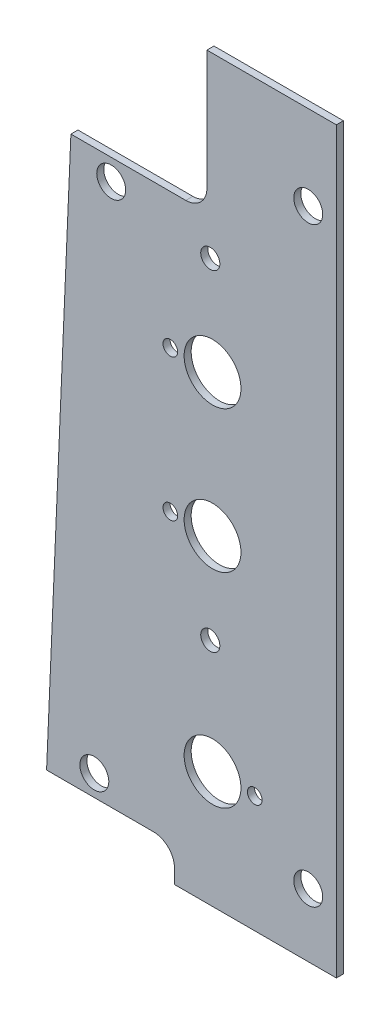
ISO-10303-21;
HEADER;
FILE_DESCRIPTION(('STEP AP214'),'2;1');
FILE_NAME('part.step','',(''),(''),'','','');
FILE_SCHEMA(('AUTOMOTIVE_DESIGN { 1 0 10303 214 1 1 1 1 }'));
ENDSEC;
DATA;
#1=APPLICATION_CONTEXT('core data for automotive mechanical design processes');
#2=APPLICATION_PROTOCOL_DEFINITION('international standard','automotive_design',2000,#1);
#3=PRODUCT_CONTEXT('',#1,'mechanical');
#4=PRODUCT('Part','Part','',(#3));
#5=PRODUCT_RELATED_PRODUCT_CATEGORY('part','',(#4));
#6=PRODUCT_DEFINITION_FORMATION('','',#4);
#7=PRODUCT_DEFINITION_CONTEXT('part definition',#1,'design');
#8=PRODUCT_DEFINITION('design','',#6,#7);
#9=PRODUCT_DEFINITION_SHAPE('','',#8);
#10=(LENGTH_UNIT() NAMED_UNIT(*) SI_UNIT(.MILLI.,.METRE.));
#11=(NAMED_UNIT(*) PLANE_ANGLE_UNIT() SI_UNIT($,.RADIAN.));
#12=(NAMED_UNIT(*) SI_UNIT($,.STERADIAN.) SOLID_ANGLE_UNIT());
#13=UNCERTAINTY_MEASURE_WITH_UNIT(LENGTH_MEASURE(1.E-05),#10,'distance_accuracy_value','');
#14=(GEOMETRIC_REPRESENTATION_CONTEXT(3) GLOBAL_UNCERTAINTY_ASSIGNED_CONTEXT((#13)) GLOBAL_UNIT_ASSIGNED_CONTEXT((#10,
#11,#12)) REPRESENTATION_CONTEXT('',''));
#15=CARTESIAN_POINT('',(0.,0.,0.));
#16=DIRECTION('',(0.,0.,1.));
#17=DIRECTION('',(1.,0.,0.));
#18=AXIS2_PLACEMENT_3D('',#15,#16,#17);
#19=CARTESIAN_POINT('',(0.01,166.6875,-0.01));
#20=DIRECTION('',(0.,1.,0.));
#21=DIRECTION('',(-1.,0.,0.));
#22=AXIS2_PLACEMENT_3D('',#19,#20,#21);
#23=PLANE('',#22);
#24=DIRECTION('',(-1.,0.,0.));
#25=VECTOR('',#24,1.);
#26=CARTESIAN_POINT('',(-32.6897252941176,166.6875,1.5875));
#27=LINE('',#26,#25);
#28=CARTESIAN_POINT('',(0.,166.6875,1.5875));
#29=VERTEX_POINT('',#28);
#30=CARTESIAN_POINT('',(-29.21,166.6875,1.5875));
#31=VERTEX_POINT('',#30);
#32=EDGE_CURVE('E111',#29,#31,#27,.T.);
#33=ORIENTED_EDGE('',*,*,#32,.F.);
#34=DIRECTION('',(0.,0.,1.));
#35=VECTOR('',#34,1.);
#36=CARTESIAN_POINT('',(0.,166.6875,0.793750000000001));
#37=LINE('',#36,#35);
#38=CARTESIAN_POINT('',(0.,166.6875,0.));
#39=VERTEX_POINT('',#38);
#40=EDGE_CURVE('E95',#39,#29,#37,.T.);
#41=ORIENTED_EDGE('',*,*,#40,.F.);
#42=DIRECTION('',(1.,0.,0.));
#43=VECTOR('',#42,1.);
#44=CARTESIAN_POINT('',(-32.6897252941177,166.6875,0.));
#45=LINE('',#44,#43);
#46=CARTESIAN_POINT('',(-29.21,166.6875,0.));
#47=VERTEX_POINT('',#46);
#48=EDGE_CURVE('E98',#47,#39,#45,.T.);
#49=ORIENTED_EDGE('',*,*,#48,.F.);
#50=DIRECTION('',(0.,0.,-1.));
#51=VECTOR('',#50,1.);
#52=CARTESIAN_POINT('',(-29.21,166.6875,0.793750000000001));
#53=LINE('',#52,#51);
#54=EDGE_CURVE('E78',#31,#47,#53,.T.);
#55=ORIENTED_EDGE('',*,*,#54,.F.);
#56=EDGE_LOOP('',(#33,#41,#49,#55));
#57=FACE_BOUND('',#56,.T.);
#58=ADVANCED_FACE('F16',(#57),#23,.T.);
#59=CARTESIAN_POINT('',(0.,-0.01,-0.01));
#60=DIRECTION('',(1.,0.,0.));
#61=DIRECTION('',(0.,1.,0.));
#62=AXIS2_PLACEMENT_3D('',#59,#60,#61);
#63=PLANE('',#62);
#64=DIRECTION('',(0.,1.,0.));
#65=VECTOR('',#64,1.);
#66=CARTESIAN_POINT('',(0.,83.34375,1.5875));
#67=LINE('',#66,#65);
#68=CARTESIAN_POINT('',(0.,0.,1.5875));
#69=VERTEX_POINT('',#68);
#70=EDGE_CURVE('E190',#69,#29,#67,.T.);
#71=ORIENTED_EDGE('',*,*,#70,.F.);
#72=DIRECTION('',(0.,0.,1.));
#73=VECTOR('',#72,1.);
#74=CARTESIAN_POINT('',(0.,0.,0.793750000000001));
#75=LINE('',#74,#73);
#76=CARTESIAN_POINT('',(0.,0.,0.));
#77=VERTEX_POINT('',#76);
#78=EDGE_CURVE('E172',#77,#69,#75,.T.);
#79=ORIENTED_EDGE('',*,*,#78,.F.);
#80=DIRECTION('',(0.,-1.,0.));
#81=VECTOR('',#80,1.);
#82=CARTESIAN_POINT('',(0.,83.34375,0.));
#83=LINE('',#82,#81);
#84=EDGE_CURVE('E102',#39,#77,#83,.T.);
#85=ORIENTED_EDGE('',*,*,#84,.F.);
#86=ORIENTED_EDGE('',*,*,#40,.T.);
#87=EDGE_LOOP('',(#71,#79,#85,#86));
#88=FACE_BOUND('',#87,.T.);
#89=ADVANCED_FACE('F296',(#88),#63,.T.);
#90=CARTESIAN_POINT('',(-36.5225,0.,-0.01));
#91=DIRECTION('',(0.,-1.,0.));
#92=DIRECTION('',(1.,0.,0.));
#93=AXIS2_PLACEMENT_3D('',#90,#91,#92);
#94=PLANE('',#93);
#95=DIRECTION('',(1.,0.,0.));
#96=VECTOR('',#95,1.);
#97=CARTESIAN_POINT('',(-32.6897252941176,0.,1.5875));
#98=LINE('',#97,#96);
#99=CARTESIAN_POINT('',(-36.5125,0.,1.5875));
#100=VERTEX_POINT('',#99);
#101=EDGE_CURVE('E141',#100,#69,#98,.T.);
#102=ORIENTED_EDGE('',*,*,#101,.F.);
#103=DIRECTION('',(0.,0.,1.));
#104=VECTOR('',#103,1.);
#105=CARTESIAN_POINT('',(-36.5125,0.,0.793750000000001));
#106=LINE('',#105,#104);
#107=CARTESIAN_POINT('',(-36.5125,0.,0.));
#108=VERTEX_POINT('',#107);
#109=EDGE_CURVE('E170',#108,#100,#106,.T.);
#110=ORIENTED_EDGE('',*,*,#109,.F.);
#111=DIRECTION('',(-1.,0.,0.));
#112=VECTOR('',#111,1.);
#113=CARTESIAN_POINT('',(-32.6897252941177,0.,0.));
#114=LINE('',#113,#112);
#115=EDGE_CURVE('E135',#77,#108,#114,.T.);
#116=ORIENTED_EDGE('',*,*,#115,.F.);
#117=ORIENTED_EDGE('',*,*,#78,.T.);
#118=EDGE_LOOP('',(#102,#110,#116,#117));
#119=FACE_BOUND('',#118,.T.);
#120=ADVANCED_FACE('F293',(#119),#94,.T.);
#121=CARTESIAN_POINT('',(-36.5125,3.18500000000001,-0.01));
#122=DIRECTION('',(-1.,0.,0.));
#123=DIRECTION('',(0.,-1.,0.));
#124=AXIS2_PLACEMENT_3D('',#121,#122,#123);
#125=PLANE('',#124);
#126=ORIENTED_EDGE('',*,*,#109,.T.);
#127=DIRECTION('',(0.,-1.,0.));
#128=VECTOR('',#127,1.);
#129=CARTESIAN_POINT('',(-36.5125,83.34375,1.5875));
#130=LINE('',#129,#128);
#131=CARTESIAN_POINT('',(-36.5125,3.175,1.5875));
#132=VERTEX_POINT('',#131);
#133=EDGE_CURVE('E138',#132,#100,#130,.T.);
#134=ORIENTED_EDGE('',*,*,#133,.F.);
#135=DIRECTION('',(0.,0.,1.));
#136=VECTOR('',#135,1.);
#137=CARTESIAN_POINT('',(-36.5125,3.175,0.79375));
#138=LINE('',#137,#136);
#139=CARTESIAN_POINT('',(-36.5125,3.175,0.));
#140=VERTEX_POINT('',#139);
#141=EDGE_CURVE('E168',#140,#132,#138,.T.);
#142=ORIENTED_EDGE('',*,*,#141,.F.);
#143=DIRECTION('',(0.,1.,0.));
#144=VECTOR('',#143,1.);
#145=CARTESIAN_POINT('',(-36.5125,83.34375,0.));
#146=LINE('',#145,#144);
#147=EDGE_CURVE('E132',#108,#140,#146,.T.);
#148=ORIENTED_EDGE('',*,*,#147,.F.);
#149=EDGE_LOOP('',(#126,#134,#142,#148));
#150=FACE_BOUND('',#149,.T.);
#151=ADVANCED_FACE('F289',(#150),#125,.T.);
#152=CARTESIAN_POINT('',(-41.275,3.175,0.));
#153=DIRECTION('',(0.,0.,1.));
#154=DIRECTION('',(1.,0.,0.));
#155=AXIS2_PLACEMENT_3D('',#152,#153,#154);
#156=CYLINDRICAL_SURFACE('',#155,4.7625);
#157=CARTESIAN_POINT('',(-41.275,3.175,1.5875));
#158=DIRECTION('',(0.,0.,1.));
#159=DIRECTION('',(1.,0.,0.));
#160=AXIS2_PLACEMENT_3D('',#157,#158,#159);
#161=CIRCLE('',#160,4.7625);
#162=CARTESIAN_POINT('',(-41.275,7.9375,1.5875));
#163=VERTEX_POINT('',#162);
#164=EDGE_CURVE('E142',#163,#132,#161,.F.);
#165=ORIENTED_EDGE('',*,*,#164,.F.);
#166=DIRECTION('',(0.,0.,1.));
#167=VECTOR('',#166,1.);
#168=CARTESIAN_POINT('',(-41.275,7.9375,0.793750000000001));
#169=LINE('',#168,#167);
#170=CARTESIAN_POINT('',(-41.275,7.9375,0.));
#171=VERTEX_POINT('',#170);
#172=EDGE_CURVE('E166',#171,#163,#169,.T.);
#173=ORIENTED_EDGE('',*,*,#172,.F.);
#174=CARTESIAN_POINT('',(-41.275,3.175,0.));
#175=DIRECTION('',(0.,0.,1.));
#176=DIRECTION('',(1.,0.,0.));
#177=AXIS2_PLACEMENT_3D('',#174,#175,#176);
#178=CIRCLE('',#177,4.7625);
#179=EDGE_CURVE('E131',#140,#171,#178,.T.);
#180=ORIENTED_EDGE('',*,*,#179,.F.);
#181=ORIENTED_EDGE('',*,*,#141,.T.);
#182=EDGE_LOOP('',(#165,#173,#180,#181));
#183=FACE_BOUND('',#182,.T.);
#184=ADVANCED_FACE('F285',(#183),#156,.F.);
#185=CARTESIAN_POINT('',(-65.3894505882353,7.9375,-0.01));
#186=DIRECTION('',(0.,-1.,0.));
#187=DIRECTION('',(1.,0.,0.));
#188=AXIS2_PLACEMENT_3D('',#185,#186,#187);
#189=PLANE('',#188);
#190=DIRECTION('',(0.,0.,1.));
#191=VECTOR('',#190,1.);
#192=CARTESIAN_POINT('',(-65.3794505882353,7.9375,0.793750000000001));
#193=LINE('',#192,#191);
#194=CARTESIAN_POINT('',(-65.3794505882353,7.9375,0.));
#195=VERTEX_POINT('',#194);
#196=CARTESIAN_POINT('',(-65.3794505882353,7.9375,1.5875));
#197=VERTEX_POINT('',#196);
#198=EDGE_CURVE('E164',#195,#197,#193,.T.);
#199=ORIENTED_EDGE('',*,*,#198,.F.);
#200=DIRECTION('',(-1.,0.,0.));
#201=VECTOR('',#200,1.);
#202=CARTESIAN_POINT('',(-32.6897252941177,7.9375,0.));
#203=LINE('',#202,#201);
#204=EDGE_CURVE('E128',#171,#195,#203,.T.);
#205=ORIENTED_EDGE('',*,*,#204,.F.);
#206=ORIENTED_EDGE('',*,*,#172,.T.);
#207=DIRECTION('',(1.,0.,0.));
#208=VECTOR('',#207,1.);
#209=CARTESIAN_POINT('',(-32.6897252941176,7.9375,1.5875));
#210=LINE('',#209,#208);
#211=EDGE_CURVE('E145',#197,#163,#210,.T.);
#212=ORIENTED_EDGE('',*,*,#211,.F.);
#213=EDGE_LOOP('',(#199,#205,#206,#212));
#214=FACE_BOUND('',#213,.T.);
#215=ADVANCED_FACE('F281',(#214),#189,.T.);
#216=CARTESIAN_POINT('',(-59.8902282148351,134.94749067373,-0.01));
#217=DIRECTION('',(-0.999067372960438,0.0431785164859707,0.));
#218=DIRECTION('',(-0.0431785164859707,-0.999067372960438,0.));
#219=AXIS2_PLACEMENT_3D('',#216,#217,#218);
#220=PLANE('',#219);
#221=DIRECTION('',(-0.0431785164859705,-0.999067372960438,0.));
#222=VECTOR('',#221,1.);
#223=CARTESIAN_POINT('',(-59.89066,134.9375,1.5875));
#224=LINE('',#223,#222);
#225=CARTESIAN_POINT('',(-59.89066,134.9375,1.5875));
#226=VERTEX_POINT('',#225);
#227=EDGE_CURVE('E148',#226,#197,#224,.T.);
#228=ORIENTED_EDGE('',*,*,#227,.F.);
#229=DIRECTION('',(0.,0.,1.));
#230=VECTOR('',#229,1.);
#231=CARTESIAN_POINT('',(-59.89066,134.9375,0.793750000000001));
#232=LINE('',#231,#230);
#233=CARTESIAN_POINT('',(-59.89066,134.9375,0.));
#234=VERTEX_POINT('',#233);
#235=EDGE_CURVE('E162',#234,#226,#232,.T.);
#236=ORIENTED_EDGE('',*,*,#235,.F.);
#237=DIRECTION('',(0.0431785164859705,0.999067372960438,0.));
#238=VECTOR('',#237,1.);
#239=CARTESIAN_POINT('',(-65.3794505882353,7.9375,0.));
#240=LINE('',#239,#238);
#241=EDGE_CURVE('E127',#195,#234,#240,.T.);
#242=ORIENTED_EDGE('',*,*,#241,.F.);
#243=ORIENTED_EDGE('',*,*,#198,.T.);
#244=EDGE_LOOP('',(#228,#236,#242,#243));
#245=FACE_BOUND('',#244,.T.);
#246=ADVANCED_FACE('F276',(#245),#220,.T.);
#247=CARTESIAN_POINT('',(-33.9625,134.9375,-0.01));
#248=DIRECTION('',(0.,1.,0.));
#249=DIRECTION('',(-1.,0.,0.));
#250=AXIS2_PLACEMENT_3D('',#247,#248,#249);
#251=PLANE('',#250);
#252=ORIENTED_EDGE('',*,*,#235,.T.);
#253=DIRECTION('',(-1.,0.,0.));
#254=VECTOR('',#253,1.);
#255=CARTESIAN_POINT('',(-32.6897252941176,134.9375,1.5875));
#256=LINE('',#255,#254);
#257=CARTESIAN_POINT('',(-33.9725,134.9375,1.5875));
#258=VERTEX_POINT('',#257);
#259=EDGE_CURVE('E149',#258,#226,#256,.T.);
#260=ORIENTED_EDGE('',*,*,#259,.F.);
#261=DIRECTION('',(0.,0.,1.));
#262=VECTOR('',#261,1.);
#263=CARTESIAN_POINT('',(-33.9725,134.9375,0.79375));
#264=LINE('',#263,#262);
#265=CARTESIAN_POINT('',(-33.9725,134.9375,0.));
#266=VERTEX_POINT('',#265);
#267=EDGE_CURVE('E155',#266,#258,#264,.T.);
#268=ORIENTED_EDGE('',*,*,#267,.F.);
#269=DIRECTION('',(1.,0.,0.));
#270=VECTOR('',#269,1.);
#271=CARTESIAN_POINT('',(-32.6897252941177,134.9375,0.));
#272=LINE('',#271,#270);
#273=EDGE_CURVE('E121',#234,#266,#272,.T.);
#274=ORIENTED_EDGE('',*,*,#273,.F.);
#275=EDGE_LOOP('',(#252,#260,#268,#274));
#276=FACE_BOUND('',#275,.T.);
#277=ADVANCED_FACE('F299',(#276),#251,.T.);
#278=CARTESIAN_POINT('',(-33.9725,139.7,0.));
#279=DIRECTION('',(0.,0.,1.));
#280=DIRECTION('',(1.,0.,0.));
#281=AXIS2_PLACEMENT_3D('',#278,#279,#280);
#282=CYLINDRICAL_SURFACE('',#281,4.76250000000002);
#283=CARTESIAN_POINT('',(-33.9725,139.7,1.5875));
#284=DIRECTION('',(0.,0.,1.));
#285=DIRECTION('',(1.,0.,0.));
#286=AXIS2_PLACEMENT_3D('',#283,#284,#285);
#287=CIRCLE('',#286,4.76250000000002);
#288=CARTESIAN_POINT('',(-29.21,139.7,1.5875));
#289=VERTEX_POINT('',#288);
#290=EDGE_CURVE('E20',#289,#258,#287,.F.);
#291=ORIENTED_EDGE('',*,*,#290,.F.);
#292=DIRECTION('',(0.,0.,1.));
#293=VECTOR('',#292,1.);
#294=CARTESIAN_POINT('',(-29.21,139.7,0.793750000000001));
#295=LINE('',#294,#293);
#296=CARTESIAN_POINT('',(-29.21,139.7,0.));
#297=VERTEX_POINT('',#296);
#298=EDGE_CURVE('E35',#297,#289,#295,.T.);
#299=ORIENTED_EDGE('',*,*,#298,.F.);
#300=CARTESIAN_POINT('',(-33.9725,139.7,0.));
#301=DIRECTION('',(0.,0.,1.));
#302=DIRECTION('',(1.,0.,0.));
#303=AXIS2_PLACEMENT_3D('',#300,#301,#302);
#304=CIRCLE('',#303,4.76250000000002);
#305=EDGE_CURVE('E115',#266,#297,#304,.T.);
#306=ORIENTED_EDGE('',*,*,#305,.F.);
#307=ORIENTED_EDGE('',*,*,#267,.T.);
#308=EDGE_LOOP('',(#291,#299,#306,#307));
#309=FACE_BOUND('',#308,.T.);
#310=ADVANCED_FACE('F297',(#309),#282,.F.);
#311=CARTESIAN_POINT('',(-29.21,166.6975,-0.01));
#312=DIRECTION('',(-1.,0.,0.));
#313=DIRECTION('',(0.,-1.,0.));
#314=AXIS2_PLACEMENT_3D('',#311,#312,#313);
#315=PLANE('',#314);
#316=ORIENTED_EDGE('',*,*,#54,.T.);
#317=DIRECTION('',(0.,1.,0.));
#318=VECTOR('',#317,1.);
#319=CARTESIAN_POINT('',(-29.21,83.34375,0.));
#320=LINE('',#319,#318);
#321=EDGE_CURVE('E106',#297,#47,#320,.T.);
#322=ORIENTED_EDGE('',*,*,#321,.F.);
#323=ORIENTED_EDGE('',*,*,#298,.T.);
#324=DIRECTION('',(0.,-1.,0.));
#325=VECTOR('',#324,1.);
#326=CARTESIAN_POINT('',(-29.21,83.34375,1.5875));
#327=LINE('',#326,#325);
#328=EDGE_CURVE('E109',#31,#289,#327,.T.);
#329=ORIENTED_EDGE('',*,*,#328,.F.);
#330=EDGE_LOOP('',(#316,#322,#323,#329));
#331=FACE_BOUND('',#330,.T.);
#332=ADVANCED_FACE('F105',(#331),#315,.T.);
#333=CARTESIAN_POINT('',(-28.448,126.365,1.5875));
#334=DIRECTION('',(0.,0.,-1.));
#335=DIRECTION('',(-1.,0.,0.));
#336=AXIS2_PLACEMENT_3D('',#333,#334,#335);
#337=CYLINDRICAL_SURFACE('',#336,2.15900000000002);
#338=CARTESIAN_POINT('',(-28.448,126.365,0.));
#339=DIRECTION('',(0.,0.,-1.));
#340=DIRECTION('',(-1.,0.,0.));
#341=AXIS2_PLACEMENT_3D('',#338,#339,#340);
#342=CIRCLE('',#341,2.15900000000002);
#343=CARTESIAN_POINT('',(-30.607,126.365,0.));
#344=VERTEX_POINT('',#343);
#345=EDGE_CURVE('E116',#344,#344,#342,.F.);
#346=ORIENTED_EDGE('',*,*,#345,.F.);
#347=EDGE_LOOP('',(#346));
#348=FACE_BOUND('',#347,.T.);
#349=CARTESIAN_POINT('',(-28.448,126.365,1.5875));
#350=DIRECTION('',(0.,0.,-1.));
#351=DIRECTION('',(-1.,0.,0.));
#352=AXIS2_PLACEMENT_3D('',#349,#350,#351);
#353=CIRCLE('',#352,2.15900000000002);
#354=CARTESIAN_POINT('',(-30.607,126.365,1.5875));
#355=VERTEX_POINT('',#354);
#356=EDGE_CURVE('E198',#355,#355,#353,.T.);
#357=ORIENTED_EDGE('',*,*,#356,.F.);
#358=EDGE_LOOP('',(#357));
#359=FACE_BOUND('',#358,.T.);
#360=ADVANCED_FACE('F365',(#348,#359),#337,.F.);
#361=CARTESIAN_POINT('',(-37.465,72.39,1.5875));
#362=DIRECTION('',(0.,0.,-1.));
#363=DIRECTION('',(-1.,0.,0.));
#364=AXIS2_PLACEMENT_3D('',#361,#362,#363);
#365=CYLINDRICAL_SURFACE('',#364,1.65099999999999);
#366=CARTESIAN_POINT('',(-37.465,72.39,0.));
#367=DIRECTION('',(0.,0.,-1.));
#368=DIRECTION('',(-1.,0.,0.));
#369=AXIS2_PLACEMENT_3D('',#366,#367,#368);
#370=CIRCLE('',#369,1.65099999999999);
#371=CARTESIAN_POINT('',(-39.116,72.39,0.));
#372=VERTEX_POINT('',#371);
#373=EDGE_CURVE('E119',#372,#372,#370,.F.);
#374=ORIENTED_EDGE('',*,*,#373,.F.);
#375=EDGE_LOOP('',(#374));
#376=FACE_BOUND('',#375,.T.);
#377=CARTESIAN_POINT('',(-37.465,72.39,1.5875));
#378=DIRECTION('',(0.,0.,-1.));
#379=DIRECTION('',(-1.,0.,0.));
#380=AXIS2_PLACEMENT_3D('',#377,#378,#379);
#381=CIRCLE('',#380,1.65099999999999);
#382=CARTESIAN_POINT('',(-39.116,72.39,1.5875));
#383=VERTEX_POINT('',#382);
#384=EDGE_CURVE('E262',#383,#383,#381,.T.);
#385=ORIENTED_EDGE('',*,*,#384,.F.);
#386=EDGE_LOOP('',(#385));
#387=FACE_BOUND('',#386,.T.);
#388=ADVANCED_FACE('F361',(#376,#387),#365,.F.);
#389=CARTESIAN_POINT('',(-27.94,26.3525,1.5875));
#390=DIRECTION('',(0.,0.,-1.));
#391=DIRECTION('',(-1.,0.,0.));
#392=AXIS2_PLACEMENT_3D('',#389,#390,#391);
#393=CYLINDRICAL_SURFACE('',#392,6.41349999999999);
#394=CARTESIAN_POINT('',(-27.94,26.3525,0.));
#395=DIRECTION('',(0.,0.,-1.));
#396=DIRECTION('',(-1.,0.,0.));
#397=AXIS2_PLACEMENT_3D('',#394,#395,#396);
#398=CIRCLE('',#397,6.41349999999999);
#399=CARTESIAN_POINT('',(-34.3535,26.3525,0.));
#400=VERTEX_POINT('',#399);
#401=EDGE_CURVE('E227',#400,#400,#398,.F.);
#402=ORIENTED_EDGE('',*,*,#401,.F.);
#403=EDGE_LOOP('',(#402));
#404=FACE_BOUND('',#403,.T.);
#405=CARTESIAN_POINT('',(-27.94,26.3525,1.5875));
#406=DIRECTION('',(0.,0.,-1.));
#407=DIRECTION('',(-1.,0.,0.));
#408=AXIS2_PLACEMENT_3D('',#405,#406,#407);
#409=CIRCLE('',#408,6.41349999999999);
#410=CARTESIAN_POINT('',(-34.3535,26.3525,1.5875));
#411=VERTEX_POINT('',#410);
#412=EDGE_CURVE('E259',#411,#411,#409,.T.);
#413=ORIENTED_EDGE('',*,*,#412,.F.);
#414=EDGE_LOOP('',(#413));
#415=FACE_BOUND('',#414,.T.);
#416=ADVANCED_FACE('F357',(#404,#415),#393,.F.);
#417=CARTESIAN_POINT('',(-37.465,104.394,1.5875));
#418=DIRECTION('',(0.,0.,-1.));
#419=DIRECTION('',(-1.,0.,0.));
#420=AXIS2_PLACEMENT_3D('',#417,#418,#419);
#421=CYLINDRICAL_SURFACE('',#420,1.65099999999999);
#422=CARTESIAN_POINT('',(-37.465,104.394,0.));
#423=DIRECTION('',(0.,0.,-1.));
#424=DIRECTION('',(-1.,0.,0.));
#425=AXIS2_PLACEMENT_3D('',#422,#423,#424);
#426=CIRCLE('',#425,1.65099999999999);
#427=CARTESIAN_POINT('',(-39.116,104.394,0.));
#428=VERTEX_POINT('',#427);
#429=EDGE_CURVE('E224',#428,#428,#426,.F.);
#430=ORIENTED_EDGE('',*,*,#429,.F.);
#431=EDGE_LOOP('',(#430));
#432=FACE_BOUND('',#431,.T.);
#433=CARTESIAN_POINT('',(-37.465,104.394,1.5875));
#434=DIRECTION('',(0.,0.,-1.));
#435=DIRECTION('',(-1.,0.,0.));
#436=AXIS2_PLACEMENT_3D('',#433,#434,#435);
#437=CIRCLE('',#436,1.65099999999999);
#438=CARTESIAN_POINT('',(-39.116,104.394,1.5875));
#439=VERTEX_POINT('',#438);
#440=EDGE_CURVE('E256',#439,#439,#437,.T.);
#441=ORIENTED_EDGE('',*,*,#440,.F.);
#442=EDGE_LOOP('',(#441));
#443=FACE_BOUND('',#442,.T.);
#444=ADVANCED_FACE('F353',(#432,#443),#421,.F.);
#445=CARTESIAN_POINT('',(-27.94,72.39,1.5875));
#446=DIRECTION('',(0.,0.,-1.));
#447=DIRECTION('',(-1.,0.,0.));
#448=AXIS2_PLACEMENT_3D('',#445,#446,#447);
#449=CYLINDRICAL_SURFACE('',#448,6.41349999999999);
#450=CARTESIAN_POINT('',(-27.94,72.39,0.));
#451=DIRECTION('',(0.,0.,-1.));
#452=DIRECTION('',(-1.,0.,0.));
#453=AXIS2_PLACEMENT_3D('',#450,#451,#452);
#454=CIRCLE('',#453,6.41349999999999);
#455=CARTESIAN_POINT('',(-34.3535,72.39,0.));
#456=VERTEX_POINT('',#455);
#457=EDGE_CURVE('E221',#456,#456,#454,.F.);
#458=ORIENTED_EDGE('',*,*,#457,.F.);
#459=EDGE_LOOP('',(#458));
#460=FACE_BOUND('',#459,.T.);
#461=CARTESIAN_POINT('',(-27.94,72.39,1.5875));
#462=DIRECTION('',(0.,0.,-1.));
#463=DIRECTION('',(-1.,0.,0.));
#464=AXIS2_PLACEMENT_3D('',#461,#462,#463);
#465=CIRCLE('',#464,6.41349999999999);
#466=CARTESIAN_POINT('',(-34.3535,72.39,1.5875));
#467=VERTEX_POINT('',#466);
#468=EDGE_CURVE('E253',#467,#467,#465,.T.);
#469=ORIENTED_EDGE('',*,*,#468,.F.);
#470=EDGE_LOOP('',(#469));
#471=FACE_BOUND('',#470,.T.);
#472=ADVANCED_FACE('F349',(#460,#471),#449,.F.);
#473=CARTESIAN_POINT('',(-18.415,26.3525,1.5875));
#474=DIRECTION('',(0.,0.,-1.));
#475=DIRECTION('',(-1.,0.,0.));
#476=AXIS2_PLACEMENT_3D('',#473,#474,#475);
#477=CYLINDRICAL_SURFACE('',#476,1.651);
#478=CARTESIAN_POINT('',(-18.415,26.3525,0.));
#479=DIRECTION('',(0.,0.,-1.));
#480=DIRECTION('',(-1.,0.,0.));
#481=AXIS2_PLACEMENT_3D('',#478,#479,#480);
#482=CIRCLE('',#481,1.651);
#483=CARTESIAN_POINT('',(-20.066,26.3525,0.));
#484=VERTEX_POINT('',#483);
#485=EDGE_CURVE('E218',#484,#484,#482,.F.);
#486=ORIENTED_EDGE('',*,*,#485,.F.);
#487=EDGE_LOOP('',(#486));
#488=FACE_BOUND('',#487,.T.);
#489=CARTESIAN_POINT('',(-18.415,26.3525,1.5875));
#490=DIRECTION('',(0.,0.,-1.));
#491=DIRECTION('',(-1.,0.,0.));
#492=AXIS2_PLACEMENT_3D('',#489,#490,#491);
#493=CIRCLE('',#492,1.651);
#494=CARTESIAN_POINT('',(-20.066,26.3525,1.5875));
#495=VERTEX_POINT('',#494);
#496=EDGE_CURVE('E250',#495,#495,#493,.T.);
#497=ORIENTED_EDGE('',*,*,#496,.F.);
#498=EDGE_LOOP('',(#497));
#499=FACE_BOUND('',#498,.T.);
#500=ADVANCED_FACE('F345',(#488,#499),#477,.F.);
#501=CARTESIAN_POINT('',(-27.94,104.394,1.5875));
#502=DIRECTION('',(0.,0.,-1.));
#503=DIRECTION('',(-1.,0.,0.));
#504=AXIS2_PLACEMENT_3D('',#501,#502,#503);
#505=CYLINDRICAL_SURFACE('',#504,6.41349999999999);
#506=CARTESIAN_POINT('',(-27.94,104.394,0.));
#507=DIRECTION('',(0.,0.,-1.));
#508=DIRECTION('',(-1.,0.,0.));
#509=AXIS2_PLACEMENT_3D('',#506,#507,#508);
#510=CIRCLE('',#509,6.41349999999999);
#511=CARTESIAN_POINT('',(-34.3535,104.394,0.));
#512=VERTEX_POINT('',#511);
#513=EDGE_CURVE('E215',#512,#512,#510,.F.);
#514=ORIENTED_EDGE('',*,*,#513,.F.);
#515=EDGE_LOOP('',(#514));
#516=FACE_BOUND('',#515,.T.);
#517=CARTESIAN_POINT('',(-27.94,104.394,1.5875));
#518=DIRECTION('',(0.,0.,-1.));
#519=DIRECTION('',(-1.,0.,0.));
#520=AXIS2_PLACEMENT_3D('',#517,#518,#519);
#521=CIRCLE('',#520,6.41349999999999);
#522=CARTESIAN_POINT('',(-34.3535,104.394,1.5875));
#523=VERTEX_POINT('',#522);
#524=EDGE_CURVE('E247',#523,#523,#521,.T.);
#525=ORIENTED_EDGE('',*,*,#524,.F.);
#526=EDGE_LOOP('',(#525));
#527=FACE_BOUND('',#526,.T.);
#528=ADVANCED_FACE('F341',(#516,#527),#505,.F.);
#529=CARTESIAN_POINT('',(-6.35,14.2875,1.5875));
#530=DIRECTION('',(0.,0.,-1.));
#531=DIRECTION('',(-1.,0.,0.));
#532=AXIS2_PLACEMENT_3D('',#529,#530,#531);
#533=CYLINDRICAL_SURFACE('',#532,3.2639);
#534=CARTESIAN_POINT('',(-6.35,14.2875,0.));
#535=DIRECTION('',(0.,0.,-1.));
#536=DIRECTION('',(-1.,0.,0.));
#537=AXIS2_PLACEMENT_3D('',#534,#535,#536);
#538=CIRCLE('',#537,3.2639);
#539=CARTESIAN_POINT('',(-9.6139,14.2875,0.));
#540=VERTEX_POINT('',#539);
#541=EDGE_CURVE('E212',#540,#540,#538,.F.);
#542=ORIENTED_EDGE('',*,*,#541,.F.);
#543=EDGE_LOOP('',(#542));
#544=FACE_BOUND('',#543,.T.);
#545=CARTESIAN_POINT('',(-6.35,14.2875,1.5875));
#546=DIRECTION('',(0.,0.,-1.));
#547=DIRECTION('',(-1.,0.,0.));
#548=AXIS2_PLACEMENT_3D('',#545,#546,#547);
#549=CIRCLE('',#548,3.2639);
#550=CARTESIAN_POINT('',(-9.6139,14.2875,1.5875));
#551=VERTEX_POINT('',#550);
#552=EDGE_CURVE('E244',#551,#551,#549,.T.);
#553=ORIENTED_EDGE('',*,*,#552,.F.);
#554=EDGE_LOOP('',(#553));
#555=FACE_BOUND('',#554,.T.);
#556=ADVANCED_FACE('F337',(#544,#555),#533,.F.);
#557=CARTESIAN_POINT('',(-50.8,130.175,1.5875));
#558=DIRECTION('',(0.,0.,-1.));
#559=DIRECTION('',(-1.,0.,0.));
#560=AXIS2_PLACEMENT_3D('',#557,#558,#559);
#561=CYLINDRICAL_SURFACE('',#560,3.26389999999998);
#562=CARTESIAN_POINT('',(-50.8,130.175,0.));
#563=DIRECTION('',(0.,0.,-1.));
#564=DIRECTION('',(-1.,0.,0.));
#565=AXIS2_PLACEMENT_3D('',#562,#563,#564);
#566=CIRCLE('',#565,3.26389999999998);
#567=CARTESIAN_POINT('',(-54.0639,130.175,0.));
#568=VERTEX_POINT('',#567);
#569=EDGE_CURVE('E209',#568,#568,#566,.F.);
#570=ORIENTED_EDGE('',*,*,#569,.F.);
#571=EDGE_LOOP('',(#570));
#572=FACE_BOUND('',#571,.T.);
#573=CARTESIAN_POINT('',(-50.8,130.175,1.5875));
#574=DIRECTION('',(0.,0.,-1.));
#575=DIRECTION('',(-1.,0.,0.));
#576=AXIS2_PLACEMENT_3D('',#573,#574,#575);
#577=CIRCLE('',#576,3.26389999999998);
#578=CARTESIAN_POINT('',(-54.0639,130.175,1.5875));
#579=VERTEX_POINT('',#578);
#580=EDGE_CURVE('E241',#579,#579,#577,.T.);
#581=ORIENTED_EDGE('',*,*,#580,.F.);
#582=EDGE_LOOP('',(#581));
#583=FACE_BOUND('',#582,.T.);
#584=ADVANCED_FACE('F333',(#572,#583),#561,.F.);
#585=CARTESIAN_POINT('',(-54.61,12.7,1.5875));
#586=DIRECTION('',(0.,0.,-1.));
#587=DIRECTION('',(-1.,0.,0.));
#588=AXIS2_PLACEMENT_3D('',#585,#586,#587);
#589=CYLINDRICAL_SURFACE('',#588,3.2639);
#590=CARTESIAN_POINT('',(-54.61,12.7,0.));
#591=DIRECTION('',(0.,0.,-1.));
#592=DIRECTION('',(-1.,0.,0.));
#593=AXIS2_PLACEMENT_3D('',#590,#591,#592);
#594=CIRCLE('',#593,3.2639);
#595=CARTESIAN_POINT('',(-57.8739,12.7,0.));
#596=VERTEX_POINT('',#595);
#597=EDGE_CURVE('E206',#596,#596,#594,.F.);
#598=ORIENTED_EDGE('',*,*,#597,.F.);
#599=EDGE_LOOP('',(#598));
#600=FACE_BOUND('',#599,.T.);
#601=CARTESIAN_POINT('',(-54.61,12.7,1.5875));
#602=DIRECTION('',(0.,0.,-1.));
#603=DIRECTION('',(-1.,0.,0.));
#604=AXIS2_PLACEMENT_3D('',#601,#602,#603);
#605=CIRCLE('',#604,3.2639);
#606=CARTESIAN_POINT('',(-57.8739,12.7,1.5875));
#607=VERTEX_POINT('',#606);
#608=EDGE_CURVE('E238',#607,#607,#605,.T.);
#609=ORIENTED_EDGE('',*,*,#608,.F.);
#610=EDGE_LOOP('',(#609));
#611=FACE_BOUND('',#610,.T.);
#612=ADVANCED_FACE('F326',(#600,#611),#589,.F.);
#613=CARTESIAN_POINT('',(-6.34999999999998,147.6375,1.5875));
#614=DIRECTION('',(0.,0.,-1.));
#615=DIRECTION('',(-1.,0.,0.));
#616=AXIS2_PLACEMENT_3D('',#613,#614,#615);
#617=CYLINDRICAL_SURFACE('',#616,3.26390000000001);
#618=CARTESIAN_POINT('',(-6.34999999999998,147.6375,0.));
#619=DIRECTION('',(0.,0.,-1.));
#620=DIRECTION('',(-1.,0.,0.));
#621=AXIS2_PLACEMENT_3D('',#618,#619,#620);
#622=CIRCLE('',#621,3.26390000000001);
#623=CARTESIAN_POINT('',(-9.61389999999999,147.6375,0.));
#624=VERTEX_POINT('',#623);
#625=EDGE_CURVE('E203',#624,#624,#622,.F.);
#626=ORIENTED_EDGE('',*,*,#625,.F.);
#627=EDGE_LOOP('',(#626));
#628=FACE_BOUND('',#627,.T.);
#629=CARTESIAN_POINT('',(-6.34999999999998,147.6375,1.5875));
#630=DIRECTION('',(0.,0.,-1.));
#631=DIRECTION('',(-1.,0.,0.));
#632=AXIS2_PLACEMENT_3D('',#629,#630,#631);
#633=CIRCLE('',#632,3.26390000000001);
#634=CARTESIAN_POINT('',(-9.61389999999999,147.6375,1.5875));
#635=VERTEX_POINT('',#634);
#636=EDGE_CURVE('E103',#635,#635,#633,.T.);
#637=ORIENTED_EDGE('',*,*,#636,.F.);
#638=EDGE_LOOP('',(#637));
#639=FACE_BOUND('',#638,.T.);
#640=ADVANCED_FACE('F320',(#628,#639),#617,.F.);
#641=CARTESIAN_POINT('',(-65.3894505882353,-0.00999999999999447,1.5875));
#642=DIRECTION('',(0.,0.,1.));
#643=DIRECTION('',(1.,0.,0.));
#644=AXIS2_PLACEMENT_3D('',#641,#642,#643);
#645=PLANE('',#644);
#646=ORIENTED_EDGE('',*,*,#636,.T.);
#647=EDGE_LOOP('',(#646));
#648=FACE_BOUND('',#647,.T.);
#649=ORIENTED_EDGE('',*,*,#608,.T.);
#650=EDGE_LOOP('',(#649));
#651=FACE_BOUND('',#650,.T.);
#652=ORIENTED_EDGE('',*,*,#580,.T.);
#653=EDGE_LOOP('',(#652));
#654=FACE_BOUND('',#653,.T.);
#655=ORIENTED_EDGE('',*,*,#552,.T.);
#656=EDGE_LOOP('',(#655));
#657=FACE_BOUND('',#656,.T.);
#658=ORIENTED_EDGE('',*,*,#524,.T.);
#659=EDGE_LOOP('',(#658));
#660=FACE_BOUND('',#659,.T.);
#661=ORIENTED_EDGE('',*,*,#496,.T.);
#662=EDGE_LOOP('',(#661));
#663=FACE_BOUND('',#662,.T.);
#664=ORIENTED_EDGE('',*,*,#468,.T.);
#665=EDGE_LOOP('',(#664));
#666=FACE_BOUND('',#665,.T.);
#667=ORIENTED_EDGE('',*,*,#440,.T.);
#668=EDGE_LOOP('',(#667));
#669=FACE_BOUND('',#668,.T.);
#670=ORIENTED_EDGE('',*,*,#412,.T.);
#671=EDGE_LOOP('',(#670));
#672=FACE_BOUND('',#671,.T.);
#673=ORIENTED_EDGE('',*,*,#384,.T.);
#674=EDGE_LOOP('',(#673));
#675=FACE_BOUND('',#674,.T.);
#676=ORIENTED_EDGE('',*,*,#356,.T.);
#677=EDGE_LOOP('',(#676));
#678=FACE_BOUND('',#677,.T.);
#679=CARTESIAN_POINT('',(-28.448,51.7525,1.5875));
#680=DIRECTION('',(0.,0.,-1.));
#681=DIRECTION('',(-1.,0.,0.));
#682=AXIS2_PLACEMENT_3D('',#679,#680,#681);
#683=CIRCLE('',#682,2.159);
#684=CARTESIAN_POINT('',(-30.607,51.7525,1.5875));
#685=VERTEX_POINT('',#684);
#686=EDGE_CURVE('E26',#685,#685,#683,.F.);
#687=ORIENTED_EDGE('',*,*,#686,.F.);
#688=EDGE_LOOP('',(#687));
#689=FACE_BOUND('',#688,.T.);
#690=ORIENTED_EDGE('',*,*,#101,.T.);
#691=ORIENTED_EDGE('',*,*,#70,.T.);
#692=ORIENTED_EDGE('',*,*,#32,.T.);
#693=ORIENTED_EDGE('',*,*,#328,.T.);
#694=ORIENTED_EDGE('',*,*,#290,.T.);
#695=ORIENTED_EDGE('',*,*,#259,.T.);
#696=ORIENTED_EDGE('',*,*,#227,.T.);
#697=ORIENTED_EDGE('',*,*,#211,.T.);
#698=ORIENTED_EDGE('',*,*,#164,.T.);
#699=ORIENTED_EDGE('',*,*,#133,.T.);
#700=EDGE_LOOP('',(#690,#691,#692,#693,#694,#695,#696,#697,#698,#699));
#701=FACE_BOUND('',#700,.T.);
#702=ADVANCED_FACE('F271',(#648,#651,#654,#657,#660,#663,#666,#669,#672,#675,#678,#689,#701),
#645,.T.);
#703=CARTESIAN_POINT('',(0.00999999999999889,-0.00999999999999447,0.));
#704=DIRECTION('',(0.,0.,-1.));
#705=DIRECTION('',(-1.,0.,0.));
#706=AXIS2_PLACEMENT_3D('',#703,#704,#705);
#707=PLANE('',#706);
#708=ORIENTED_EDGE('',*,*,#625,.T.);
#709=EDGE_LOOP('',(#708));
#710=FACE_BOUND('',#709,.T.);
#711=ORIENTED_EDGE('',*,*,#597,.T.);
#712=EDGE_LOOP('',(#711));
#713=FACE_BOUND('',#712,.T.);
#714=ORIENTED_EDGE('',*,*,#569,.T.);
#715=EDGE_LOOP('',(#714));
#716=FACE_BOUND('',#715,.T.);
#717=ORIENTED_EDGE('',*,*,#541,.T.);
#718=EDGE_LOOP('',(#717));
#719=FACE_BOUND('',#718,.T.);
#720=ORIENTED_EDGE('',*,*,#513,.T.);
#721=EDGE_LOOP('',(#720));
#722=FACE_BOUND('',#721,.T.);
#723=ORIENTED_EDGE('',*,*,#485,.T.);
#724=EDGE_LOOP('',(#723));
#725=FACE_BOUND('',#724,.T.);
#726=ORIENTED_EDGE('',*,*,#457,.T.);
#727=EDGE_LOOP('',(#726));
#728=FACE_BOUND('',#727,.T.);
#729=ORIENTED_EDGE('',*,*,#429,.T.);
#730=EDGE_LOOP('',(#729));
#731=FACE_BOUND('',#730,.T.);
#732=ORIENTED_EDGE('',*,*,#401,.T.);
#733=EDGE_LOOP('',(#732));
#734=FACE_BOUND('',#733,.T.);
#735=ORIENTED_EDGE('',*,*,#373,.T.);
#736=EDGE_LOOP('',(#735));
#737=FACE_BOUND('',#736,.T.);
#738=ORIENTED_EDGE('',*,*,#345,.T.);
#739=EDGE_LOOP('',(#738));
#740=FACE_BOUND('',#739,.T.);
#741=CARTESIAN_POINT('',(-28.448,51.7525,0.));
#742=DIRECTION('',(0.,0.,-1.));
#743=DIRECTION('',(-1.,0.,0.));
#744=AXIS2_PLACEMENT_3D('',#741,#742,#743);
#745=CIRCLE('',#744,2.159);
#746=CARTESIAN_POINT('',(-30.607,51.7525,0.));
#747=VERTEX_POINT('',#746);
#748=EDGE_CURVE('E11',#747,#747,#745,.T.);
#749=ORIENTED_EDGE('',*,*,#748,.F.);
#750=EDGE_LOOP('',(#749));
#751=FACE_BOUND('',#750,.T.);
#752=ORIENTED_EDGE('',*,*,#305,.T.);
#753=ORIENTED_EDGE('',*,*,#321,.T.);
#754=ORIENTED_EDGE('',*,*,#48,.T.);
#755=ORIENTED_EDGE('',*,*,#84,.T.);
#756=ORIENTED_EDGE('',*,*,#115,.T.);
#757=ORIENTED_EDGE('',*,*,#147,.T.);
#758=ORIENTED_EDGE('',*,*,#179,.T.);
#759=ORIENTED_EDGE('',*,*,#204,.T.);
#760=ORIENTED_EDGE('',*,*,#241,.T.);
#761=ORIENTED_EDGE('',*,*,#273,.T.);
#762=EDGE_LOOP('',(#752,#753,#754,#755,#756,#757,#758,#759,#760,#761));
#763=FACE_BOUND('',#762,.T.);
#764=ADVANCED_FACE('F113',(#710,#713,#716,#719,#722,#725,#728,#731,#734,#737,#740,#751,#763),
#707,.T.);
#765=CARTESIAN_POINT('',(-28.448,51.7525,1.5875));
#766=DIRECTION('',(0.,0.,-1.));
#767=DIRECTION('',(-1.,0.,0.));
#768=AXIS2_PLACEMENT_3D('',#765,#766,#767);
#769=CYLINDRICAL_SURFACE('',#768,2.159);
#770=ORIENTED_EDGE('',*,*,#748,.T.);
#771=EDGE_LOOP('',(#770));
#772=FACE_BOUND('',#771,.T.);
#773=ORIENTED_EDGE('',*,*,#686,.T.);
#774=EDGE_LOOP('',(#773));
#775=FACE_BOUND('',#774,.T.);
#776=ADVANCED_FACE('F18',(#772,#775),#769,.F.);
#777=CLOSED_SHELL('',(#58,#89,#120,#151,#184,#215,#246,#277,#310,#332,#360,#388,#416,#444,#472,
#500,#528,#556,#584,#612,#640,#702,#764,#776));
#778=MANIFOLD_SOLID_BREP('B1',#777);
#779=ADVANCED_BREP_SHAPE_REPRESENTATION('',(#18,#778),#14);
#780=SHAPE_DEFINITION_REPRESENTATION(#9,#779);
ENDSEC;
END-ISO-10303-21;
